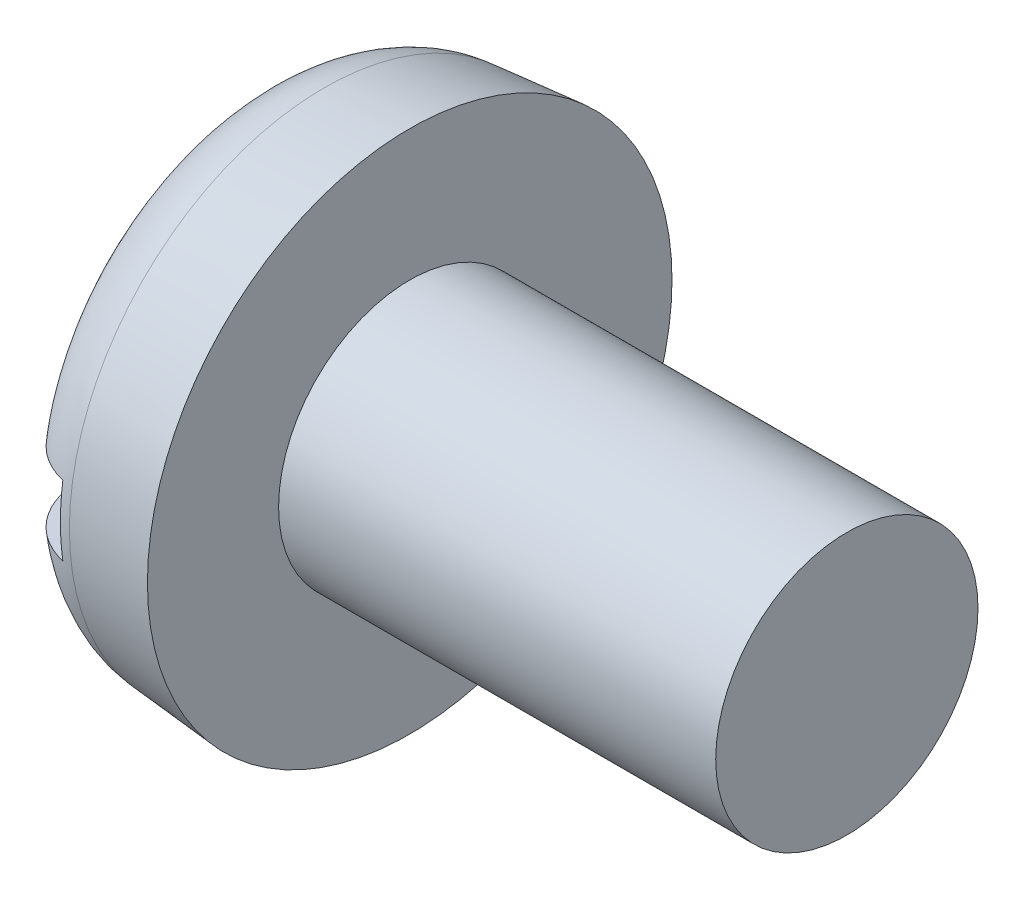
ISO-10303-21;
HEADER;
FILE_DESCRIPTION(('STEP AP214'),'2;1');
FILE_NAME('part.step','',(''),(''),'','','');
FILE_SCHEMA(('AUTOMOTIVE_DESIGN { 1 0 10303 214 1 1 1 1 }'));
ENDSEC;
DATA;
#1=APPLICATION_CONTEXT('core data for automotive mechanical design processes');
#2=APPLICATION_PROTOCOL_DEFINITION('international standard','automotive_design',2000,#1);
#3=PRODUCT_CONTEXT('',#1,'mechanical');
#4=PRODUCT('Part','Part','',(#3));
#5=PRODUCT_RELATED_PRODUCT_CATEGORY('part','',(#4));
#6=PRODUCT_DEFINITION_FORMATION('','',#4);
#7=PRODUCT_DEFINITION_CONTEXT('part definition',#1,'design');
#8=PRODUCT_DEFINITION('design','',#6,#7);
#9=PRODUCT_DEFINITION_SHAPE('','',#8);
#10=(LENGTH_UNIT() NAMED_UNIT(*) SI_UNIT(.MILLI.,.METRE.));
#11=(NAMED_UNIT(*) PLANE_ANGLE_UNIT() SI_UNIT($,.RADIAN.));
#12=(NAMED_UNIT(*) SI_UNIT($,.STERADIAN.) SOLID_ANGLE_UNIT());
#13=UNCERTAINTY_MEASURE_WITH_UNIT(LENGTH_MEASURE(1.E-05),#10,'distance_accuracy_value','');
#14=(GEOMETRIC_REPRESENTATION_CONTEXT(3) GLOBAL_UNCERTAINTY_ASSIGNED_CONTEXT((#13)) GLOBAL_UNIT_ASSIGNED_CONTEXT((#10,
#11,#12)) REPRESENTATION_CONTEXT('',''));
#15=CARTESIAN_POINT('',(0.,0.,0.));
#16=DIRECTION('',(0.,0.,1.));
#17=DIRECTION('',(1.,0.,0.));
#18=AXIS2_PLACEMENT_3D('',#15,#16,#17);
#19=CARTESIAN_POINT('',(0.,0.,0.));
#20=DIRECTION('',(-1.,0.,0.));
#21=DIRECTION('',(0.,0.,1.));
#22=AXIS2_PLACEMENT_3D('',#19,#20,#21);
#23=PLANE('',#22);
#24=DIRECTION('',(0.,0.,-1.));
#25=VECTOR('',#24,1.);
#26=CARTESIAN_POINT('',(0.,0.799999999999999,6.));
#27=LINE('',#26,#25);
#28=CARTESIAN_POINT('',(0.,0.799999999999999,3.9555566143216));
#29=VERTEX_POINT('',#28);
#30=CARTESIAN_POINT('',(0.,0.799999999999999,-3.9555566143216));
#31=VERTEX_POINT('',#30);
#32=EDGE_CURVE('E85',#29,#31,#27,.T.);
#33=ORIENTED_EDGE('',*,*,#32,.F.);
#34=CARTESIAN_POINT('',(0.,0.,0.));
#35=DIRECTION('',(-1.,0.,0.));
#36=DIRECTION('',(0.,0.,1.));
#37=AXIS2_PLACEMENT_3D('',#34,#35,#36);
#38=CIRCLE('',#37,4.03564469807531);
#39=EDGE_CURVE('E91',#29,#31,#38,.T.);
#40=ORIENTED_EDGE('',*,*,#39,.T.);
#41=EDGE_LOOP('',(#33,#40));
#42=FACE_BOUND('',#41,.T.);
#43=ADVANCED_FACE('F32',(#42),#23,.T.);
#44=CARTESIAN_POINT('',(-25.4,0.,0.));
#45=DIRECTION('',(-1.,0.,0.));
#46=DIRECTION('',(0.,0.,1.));
#47=AXIS2_PLACEMENT_3D('',#44,#45,#46);
#48=CYLINDRICAL_SURFACE('',#47,3.);
#49=CARTESIAN_POINT('',(13.6,0.,0.));
#50=DIRECTION('',(-1.,0.,0.));
#51=DIRECTION('',(0.,0.,1.));
#52=AXIS2_PLACEMENT_3D('',#49,#50,#51);
#53=CIRCLE('',#52,3.);
#54=CARTESIAN_POINT('',(13.6,0.,3.));
#55=VERTEX_POINT('',#54);
#56=EDGE_CURVE('E92',#55,#55,#53,.T.);
#57=ORIENTED_EDGE('',*,*,#56,.T.);
#58=EDGE_LOOP('',(#57));
#59=FACE_BOUND('',#58,.T.);
#60=CARTESIAN_POINT('',(3.6,0.,0.));
#61=DIRECTION('',(-1.,0.,0.));
#62=DIRECTION('',(0.,0.,1.));
#63=AXIS2_PLACEMENT_3D('',#60,#61,#62);
#64=CIRCLE('',#63,3.);
#65=CARTESIAN_POINT('',(3.6,0.,3.));
#66=VERTEX_POINT('',#65);
#67=EDGE_CURVE('E149',#66,#66,#64,.T.);
#68=ORIENTED_EDGE('',*,*,#67,.F.);
#69=EDGE_LOOP('',(#68));
#70=FACE_BOUND('',#69,.T.);
#71=ADVANCED_FACE('F137',(#59,#70),#48,.T.);
#72=CARTESIAN_POINT('',(13.6,3.,0.));
#73=DIRECTION('',(1.,0.,0.));
#74=DIRECTION('',(0.,0.,-1.));
#75=AXIS2_PLACEMENT_3D('',#72,#73,#74);
#76=PLANE('',#75);
#77=ORIENTED_EDGE('',*,*,#56,.F.);
#78=EDGE_LOOP('',(#77));
#79=FACE_BOUND('',#78,.T.);
#80=ADVANCED_FACE('F135',(#79),#76,.T.);
#81=DIRECTION('',(0.,0.,1.));
#82=VECTOR('',#81,1.);
#83=CARTESIAN_POINT('',(0.,-0.799999999999999,-6.));
#84=LINE('',#83,#82);
#85=CARTESIAN_POINT('',(0.,-0.799999999999999,-3.9555566143216));
#86=VERTEX_POINT('',#85);
#87=CARTESIAN_POINT('',(0.,-0.800000000000001,3.9555566143216));
#88=VERTEX_POINT('',#87);
#89=EDGE_CURVE('E76',#86,#88,#84,.T.);
#90=ORIENTED_EDGE('',*,*,#89,.F.);
#91=EDGE_CURVE('E83',#86,#88,#38,.T.);
#92=ORIENTED_EDGE('',*,*,#91,.T.);
#93=EDGE_LOOP('',(#90,#92));
#94=FACE_BOUND('',#93,.T.);
#95=ADVANCED_FACE('F82',(#94),#23,.T.);
#96=CARTESIAN_POINT('',(0.,0.,0.));
#97=DIRECTION('',(1.,0.,0.));
#98=DIRECTION('',(0.,0.,-1.));
#99=AXIS2_PLACEMENT_3D('',#96,#97,#98);
#100=CONICAL_SURFACE('',#99,5.68504081130667,0.0872664625997168);
#101=CARTESIAN_POINT('',(1.64311966305422,0.,0.));
#102=DIRECTION('',(-1.,0.,0.));
#103=DIRECTION('',(0.,0.,1.));
#104=AXIS2_PLACEMENT_3D('',#101,#102,#103);
#105=CIRCLE('',#104,5.82879515464045);
#106=CARTESIAN_POINT('',(1.64311966305422,0.,5.82879515464045));
#107=VERTEX_POINT('',#106);
#108=EDGE_CURVE('E95',#107,#107,#105,.F.);
#109=ORIENTED_EDGE('',*,*,#108,.T.);
#110=EDGE_LOOP('',(#109));
#111=FACE_BOUND('',#110,.T.);
#112=CARTESIAN_POINT('',(3.6,0.,0.));
#113=DIRECTION('',(-1.,0.,0.));
#114=DIRECTION('',(0.,0.,1.));
#115=AXIS2_PLACEMENT_3D('',#112,#113,#114);
#116=CIRCLE('',#115,6.);
#117=CARTESIAN_POINT('',(3.6,0.,6.));
#118=VERTEX_POINT('',#117);
#119=EDGE_CURVE('E97',#118,#118,#116,.T.);
#120=ORIENTED_EDGE('',*,*,#119,.T.);
#121=EDGE_LOOP('',(#120));
#122=FACE_BOUND('',#121,.T.);
#123=ADVANCED_FACE('F128',(#111,#122),#100,.T.);
#124=CARTESIAN_POINT('',(3.6,3.,0.));
#125=DIRECTION('',(-1.,0.,0.));
#126=DIRECTION('',(0.,0.,1.));
#127=AXIS2_PLACEMENT_3D('',#124,#125,#126);
#128=PLANE('',#127);
#129=ORIENTED_EDGE('',*,*,#119,.F.);
#130=EDGE_LOOP('',(#129));
#131=FACE_BOUND('',#130,.T.);
#132=ORIENTED_EDGE('',*,*,#67,.T.);
#133=EDGE_LOOP('',(#132));
#134=FACE_BOUND('',#133,.T.);
#135=ADVANCED_FACE('F124',(#131,#134),#128,.F.);
#136=CARTESIAN_POINT('',(1.8,0.,0.));
#137=DIRECTION('',(-1.,0.,0.));
#138=DIRECTION('',(0.,0.,1.));
#139=AXIS2_PLACEMENT_3D('',#136,#137,#138);
#140=TOROIDAL_SURFACE('',#139,4.03564469807531,1.8);
#141=CARTESIAN_POINT('',(0.540762779772504,0.799999999999999,-5.2613759856627));
#142=CARTESIAN_POINT('',(0.612348267833114,0.799999999999999,-5.33226007170116));
#143=CARTESIAN_POINT('',(0.689931624483257,0.799999999999999,-5.3971854360864));
#144=CARTESIAN_POINT('',(0.854947480958875,0.799999999999999,-5.51316161419667));
#145=CARTESIAN_POINT('',(0.94239068403974,0.799999999999999,-5.56419714083425));
#146=CARTESIAN_POINT('',(1.12461220777288,0.799999999999999,-5.650821698781));
#147=CARTESIAN_POINT('',(1.21938917495191,0.799999999999999,-5.6864135722998));
#148=CARTESIAN_POINT('',(1.41356630869313,0.799999999999999,-5.74109194486802));
#149=CARTESIAN_POINT('',(1.51296538612706,0.799999999999999,-5.76018231167996));
#150=CARTESIAN_POINT('',(1.71313899884107,0.799999999999999,-5.78126121010733));
#151=CARTESIAN_POINT('',(1.81390602781744,0.799999999999999,-5.78332104849312));
#152=CARTESIAN_POINT('',(2.01435310870812,0.799999999999999,-5.77046455591491));
#153=CARTESIAN_POINT('',(2.11403314136679,0.799999999999999,-5.75554792471215));
#154=CARTESIAN_POINT('',(2.309314019599,0.799999999999999,-5.70921606698696));
#155=CARTESIAN_POINT('',(2.40492104285082,0.799999999999999,-5.67782686375404));
#156=CARTESIAN_POINT('',(2.58952927366997,0.799999999999999,-5.59948776999251));
#157=CARTESIAN_POINT('',(2.67853045965259,0.799999999999999,-5.55253782862158));
#158=CARTESIAN_POINT('',(2.84769451709795,0.799999999999999,-5.44428887284169));
#159=CARTESIAN_POINT('',(2.92783091190503,0.799999999999999,-5.38294849495739));
#160=CARTESIAN_POINT('',(3.07676159380061,0.799999999999999,-5.24777626794688));
#161=CARTESIAN_POINT('',(3.1455556000378,0.799999999999999,-5.17394410960072));
#162=CARTESIAN_POINT('',(3.27042510006679,0.799999999999999,-5.01531035004638));
#163=CARTESIAN_POINT('',(3.32640120093555,0.799999999999999,-4.93043053468211));
#164=CARTESIAN_POINT('',(3.4235057335277,0.799999999999999,-4.75256933107917));
#165=CARTESIAN_POINT('',(3.46463341173424,0.799999999999999,-4.65958753198411));
#166=CARTESIAN_POINT('',(3.53144158740719,0.799999999999999,-4.46694835930406));
#167=CARTESIAN_POINT('',(3.55692557695194,0.799999999999999,-4.36722286731019));
#168=CARTESIAN_POINT('',(3.59108701240466,0.799999999999999,-4.16493761370543));
#169=CARTESIAN_POINT('',(3.59976314730697,0.799999999999999,-4.06237763163827));
#170=CARTESIAN_POINT('',(3.60023112204594,0.799999999999999,-3.85550711797727));
#171=CARTESIAN_POINT('',(3.59173848020812,0.799999999999999,-3.75119596435576));
#172=CARTESIAN_POINT('',(3.55768438775145,0.799999999999999,-3.54539907321037));
#173=CARTESIAN_POINT('',(3.53212117001275,0.799999999999999,-3.44391362933273));
#174=CARTESIAN_POINT('',(3.46412322657621,0.799999999999999,-3.24471369522716));
#175=CARTESIAN_POINT('',(3.42139292448942,0.799999999999999,-3.14710004339202));
#176=CARTESIAN_POINT('',(3.32030286126869,0.799999999999999,-2.96031799684206));
#177=CARTESIAN_POINT('',(3.26194098746564,0.799999999999999,-2.87115074589868));
#178=CARTESIAN_POINT('',(3.13053846590042,0.799999999999999,-2.70303664476894));
#179=CARTESIAN_POINT('',(3.05736818947569,0.799999999999999,-2.62419095430027));
#180=CARTESIAN_POINT('',(2.89859048019691,0.799999999999999,-2.48017518003935));
#181=CARTESIAN_POINT('',(2.81298317052277,0.799999999999999,-2.41500496081701));
#182=CARTESIAN_POINT('',(2.6334271917975,0.799999999999999,-2.30187272884191));
#183=CARTESIAN_POINT('',(2.53967929429022,0.799999999999999,-2.25359299068592));
#184=CARTESIAN_POINT('',(2.34507363608623,0.799999999999999,-2.17455467657048));
#185=CARTESIAN_POINT('',(2.24421969391145,0.799999999999999,-2.14378676989656));
#186=CARTESIAN_POINT('',(2.04443930043831,0.799999999999999,-2.10254396085451));
#187=CARTESIAN_POINT('',(1.94573097864464,0.799999999999999,-2.09101175757253));
#188=CARTESIAN_POINT('',(1.74783816921245,0.799999999999999,-2.08550669067498));
#189=CARTESIAN_POINT('',(1.64865381611907,0.799999999999999,-2.09152912719204));
#190=CARTESIAN_POINT('',(1.45702700128851,0.799999999999999,-2.12018138669895));
#191=CARTESIAN_POINT('',(1.36447664311325,0.799999999999999,-2.14209986414969));
#192=CARTESIAN_POINT('',(1.18420660887442,0.799999999999999,-2.20075771988038));
#193=CARTESIAN_POINT('',(1.09648771677086,0.799999999999999,-2.23749949540336));
#194=CARTESIAN_POINT('',(0.925723712262197,0.799999999999999,-2.32557805989792));
#195=CARTESIAN_POINT('',(0.842868129539058,0.799999999999999,-2.37728131212897));
#196=CARTESIAN_POINT('',(0.686362373553197,0.799999999999999,-2.493116771694));
#197=CARTESIAN_POINT('',(0.612714484293673,0.799999999999999,-2.55725205281721));
#198=CARTESIAN_POINT('',(0.472161131150062,0.799999999999999,-2.70027682193658));
#199=CARTESIAN_POINT('',(0.405916890621632,0.799999999999999,-2.77981681647101));
#200=CARTESIAN_POINT('',(0.287173334850298,0.799999999999999,-2.9485732644704));
#201=CARTESIAN_POINT('',(0.234676689699709,0.799999999999999,-3.03779159293386));
#202=CARTESIAN_POINT('',(0.143214450603964,0.799999999999999,-3.22677844667971));
#203=CARTESIAN_POINT('',(0.104782434188803,0.799999999999999,-3.32680584966186));
#204=CARTESIAN_POINT('',(0.0452446811445119,0.799999999999999,-3.5318922427284));
#205=CARTESIAN_POINT('',(0.0241387825809879,0.799999999999999,-3.63695118577701));
#206=CARTESIAN_POINT('',(-1.12670491657741E-05,0.799999999999999,-3.84916824961405));
#207=CARTESIAN_POINT('',(-0.00304965106473576,0.799999999999999,-3.95632702970971));
#208=CARTESIAN_POINT('',(0.00921984656727759,0.799999999999999,-4.16962319904359));
#209=CARTESIAN_POINT('',(0.0245310191193007,0.799999999999999,-4.27576040162512));
#210=CARTESIAN_POINT('',(0.0728327354457025,0.799999999999999,-4.48216521024852));
#211=CARTESIAN_POINT('',(0.105541716926033,0.799999999999999,-4.58249883820926));
#212=CARTESIAN_POINT('',(0.187634706209927,0.799999999999999,-4.77599767564168));
#213=CARTESIAN_POINT('',(0.236996530319204,0.799999999999999,-4.86917222023919));
#214=CARTESIAN_POINT('',(0.329466421611779,0.799999999999999,-5.01228034019194));
#215=CARTESIAN_POINT('',(0.367921794022496,0.799999999999999,-5.06527765273015));
#216=CARTESIAN_POINT('',(0.450329512489138,0.799999999999999,-5.16681267030748));
#217=CARTESIAN_POINT('',(0.494281795276485,0.799999999999999,-5.21535042666423));
#218=CARTESIAN_POINT('',(0.540762779772504,0.799999999999999,-5.2613759856627));
#219=B_SPLINE_CURVE_WITH_KNOTS('',3,(#141,#142,#143,#144,#145,#146,#147,#148,#149,#150,#151,
#152,#153,#154,#155,#156,#157,#158,#159,#160,#161,#162,#163,#164,#165,#166,#167,#168,#169,#170,
#171,#172,#173,#174,#175,#176,#177,#178,#179,#180,#181,#182,#183,#184,#185,#186,#187,#188,#189,
#190,#191,#192,#193,#194,#195,#196,#197,#198,#199,#200,#201,#202,#203,#204,#205,#206,#207,#208,
#209,#210,#211,#212,#213,#214,#215,#216,#217,#218),.UNSPECIFIED.,.T.,.F.,(4,2,2,2,2,2,2,2,2,2,2,
2,2,2,2,2,2,2,2,2,2,2,2,2,2,2,2,2,2,2,2,2,2,2,2,2,2,2,4),(0.,0.301990665553571,
0.604312368689126,0.906578409704398,1.20877358382585,1.50970282356457,1.81063738549513,
2.11109795731507,2.41155951085344,2.71289551957028,3.01423898861247,3.31784547930251,
3.6214673750267,3.92882908454075,4.23621476717483,4.54873547778502,4.86128854507609,
5.17947093252907,5.49769634531691,5.81883829248559,6.13997705919035,6.45470120134885,
6.76925749373848,7.06587349636817,7.36241009390429,7.64643650558142,7.93050886880334,
8.22223277783168,8.51402890710833,8.8231740529347,9.13237919724671,9.45232886972293,
9.77227555183242,10.0923243536798,10.4124305633264,10.7275071903339,11.042165741933,
11.2382527614178,11.4343375241794),.UNSPECIFIED.);
#220=CARTESIAN_POINT('',(1.4,0.799999999999999,-5.73510972270059));
#221=VERTEX_POINT('',#220);
#222=EDGE_CURVE('E11',#31,#221,#219,.T.);
#223=ORIENTED_EDGE('',*,*,#222,.F.);
#224=ORIENTED_EDGE('',*,*,#39,.F.);
#225=CARTESIAN_POINT('',(0.836266142673704,0.799999999999999,2.3847675344192));
#226=CARTESIAN_POINT('',(0.917616920395549,0.799999999999999,2.33037611985148));
#227=CARTESIAN_POINT('',(1.00338812809191,0.799999999999999,2.28250940898636));
#228=CARTESIAN_POINT('',(1.18171371257086,0.799999999999999,2.20157945647336));
#229=CARTESIAN_POINT('',(1.27427138419532,0.799999999999999,2.16852346158101));
#230=CARTESIAN_POINT('',(1.46387360375784,0.799999999999999,2.11861651463578));
#231=CARTESIAN_POINT('',(1.56092620726988,0.799999999999999,2.10179593736475));
#232=CARTESIAN_POINT('',(1.75645828986596,0.799999999999999,2.08531619913094));
#233=CARTESIAN_POINT('',(1.85493729786073,0.799999999999999,2.08565149582934));
#234=CARTESIAN_POINT('',(2.04724581885373,0.799999999999999,2.10316628821439));
#235=CARTESIAN_POINT('',(2.1411242466631,0.799999999999999,2.11981673272017));
#236=CARTESIAN_POINT('',(2.32483197664105,0.799999999999999,2.16840533825103));
#237=CARTESIAN_POINT('',(2.41466058319104,0.799999999999999,2.20034611475993));
#238=CARTESIAN_POINT('',(2.58937479658255,0.799999999999999,2.27883470838468));
#239=CARTESIAN_POINT('',(2.67416016608233,0.799999999999999,2.32560484151197));
#240=CARTESIAN_POINT('',(2.83527159661578,0.799999999999999,2.43194790875205));
#241=CARTESIAN_POINT('',(2.91159566808818,0.799999999999999,2.4915238443409));
#242=CARTESIAN_POINT('',(3.05833847206813,0.799999999999999,2.62557742394097));
#243=CARTESIAN_POINT('',(3.12814463920814,0.799999999999999,2.70072607421442));
#244=CARTESIAN_POINT('',(3.25476371599267,0.799999999999999,2.86127427469928));
#245=CARTESIAN_POINT('',(3.31157384747779,0.799999999999999,2.94667601077194));
#246=CARTESIAN_POINT('',(3.41282909605205,0.799999999999999,3.12914373500798));
#247=CARTESIAN_POINT('',(3.4566732787476,0.799999999999999,3.22654397769993));
#248=CARTESIAN_POINT('',(3.52749042959911,0.799999999999999,3.42730182448779));
#249=CARTESIAN_POINT('',(3.55446245509905,0.799999999999999,3.53065976109082));
#250=CARTESIAN_POINT('',(3.59074777581197,0.799999999999999,3.74099682308468));
#251=CARTESIAN_POINT('',(3.59996828480699,0.799999999999999,3.84799201669904));
#252=CARTESIAN_POINT('',(3.60003154521387,0.799999999999999,4.06199242805616));
#253=CARTESIAN_POINT('',(3.59087543963191,0.799999999999999,4.16899764476154));
#254=CARTESIAN_POINT('',(3.5545508836994,0.799999999999999,4.37828946953499));
#255=CARTESIAN_POINT('',(3.5276490501339,0.799999999999999,4.48062230606525));
#256=CARTESIAN_POINT('',(3.45672417667962,0.799999999999999,4.67917518429467));
#257=CARTESIAN_POINT('',(3.41270279239386,0.799999999999999,4.77539581604843));
#258=CARTESIAN_POINT('',(3.30967441571423,0.799999999999999,4.95711293936014));
#259=CARTESIAN_POINT('',(3.2509575917222,0.799999999999999,5.04277397494754));
#260=CARTESIAN_POINT('',(3.11977209379603,0.799999999999999,5.20282644762345));
#261=CARTESIAN_POINT('',(3.04730458946901,0.799999999999999,5.27721884223437));
#262=CARTESIAN_POINT('',(2.89186263836087,0.799999999999999,5.41145672931945));
#263=CARTESIAN_POINT('',(2.80906226498412,0.799999999999999,5.47150384635816));
#264=CARTESIAN_POINT('',(2.63447307414862,0.799999999999999,5.57667826647956));
#265=CARTESIAN_POINT('',(2.54268479385402,0.799999999999999,5.62180646049025));
#266=CARTESIAN_POINT('',(2.35372245855627,0.799999999999999,5.69541178601739));
#267=CARTESIAN_POINT('',(2.25661170214885,0.799999999999999,5.72405148642268));
#268=CARTESIAN_POINT('',(2.05894963569563,0.799999999999999,5.76452632903134));
#269=CARTESIAN_POINT('',(1.95839844559039,0.799999999999999,5.77636205644549));
#270=CARTESIAN_POINT('',(1.75726466993558,0.799999999999999,5.78286013265482));
#271=CARTESIAN_POINT('',(1.65668492734368,0.799999999999999,5.77761084028505));
#272=CARTESIAN_POINT('',(1.45783846372769,0.799999999999999,5.75028865632157));
#273=CARTESIAN_POINT('',(1.35957171560434,0.799999999999999,5.72821596193375));
#274=CARTESIAN_POINT('',(1.16819371267695,0.799999999999999,5.66791633540255));
#275=CARTESIAN_POINT('',(1.07507939389964,0.799999999999999,5.62969912319174));
#276=CARTESIAN_POINT('',(0.896555358732774,0.799999999999999,5.53823241598758));
#277=CARTESIAN_POINT('',(0.811145708608114,0.799999999999999,5.4849827917225));
#278=CARTESIAN_POINT('',(0.650082876219721,0.799999999999999,5.36476593037792));
#279=CARTESIAN_POINT('',(0.574468804826387,0.799999999999999,5.29774630893073));
#280=CARTESIAN_POINT('',(0.435451535945253,0.799999999999999,5.15205983914348));
#281=CARTESIAN_POINT('',(0.372048731656855,0.799999999999999,5.07339261589811));
#282=CARTESIAN_POINT('',(0.258650816330336,0.799999999999999,4.90594446263168));
#283=CARTESIAN_POINT('',(0.208774635933078,0.799999999999999,4.81708301699831));
#284=CARTESIAN_POINT('',(0.124428147888649,0.799999999999999,4.63233098726459));
#285=CARTESIAN_POINT('',(0.0899587510920719,0.799999999999999,4.53643998796633));
#286=CARTESIAN_POINT('',(0.0368868820421768,0.799999999999999,4.33899079972006));
#287=CARTESIAN_POINT('',(0.0185025255877267,0.799999999999999,4.23737401613092));
#288=CARTESIAN_POINT('',(-0.00125734799088122,0.799999999999999,4.03250747712129));
#289=CARTESIAN_POINT('',(-0.00263209949744705,0.799999999999999,3.9292576484054));
#290=CARTESIAN_POINT('',(0.0116307665412094,0.799999999999999,3.72214563494947));
#291=CARTESIAN_POINT('',(0.0275632061751764,0.799999999999999,3.61830377486544));
#292=CARTESIAN_POINT('',(0.0763335967887615,0.799999999999999,3.41464106293113));
#293=CARTESIAN_POINT('',(0.10917724967951,0.799999999999999,3.31482157954313));
#294=CARTESIAN_POINT('',(0.191511099721982,0.799999999999999,3.12021092040486));
#295=CARTESIAN_POINT('',(0.241286347194323,0.799999999999999,3.02554040328379));
#296=CARTESIAN_POINT('',(0.355915618814842,0.799999999999999,2.8458978279608));
#297=CARTESIAN_POINT('',(0.420755571218364,0.799999999999999,2.76091682866338));
#298=CARTESIAN_POINT('',(0.543269993526277,0.799999999999999,2.62572980615078));
#299=CARTESIAN_POINT('',(0.597683333164855,0.799999999999999,2.57253239665292));
#300=CARTESIAN_POINT('',(0.712598229155983,0.799999999999999,2.4731680246369));
#301=CARTESIAN_POINT('',(0.773099631725334,0.799999999999999,2.42700088460961));
#302=CARTESIAN_POINT('',(0.836266142673704,0.799999999999999,2.3847675344192));
#303=B_SPLINE_CURVE_WITH_KNOTS('',3,(#225,#226,#227,#228,#229,#230,#231,#232,#233,#234,#235,
#236,#237,#238,#239,#240,#241,#242,#243,#244,#245,#246,#247,#248,#249,#250,#251,#252,#253,#254,
#255,#256,#257,#258,#259,#260,#261,#262,#263,#264,#265,#266,#267,#268,#269,#270,#271,#272,#273,
#274,#275,#276,#277,#278,#279,#280,#281,#282,#283,#284,#285,#286,#287,#288,#289,#290,#291,#292,
#293,#294,#295,#296,#297,#298,#299,#300,#301,#302),.UNSPECIFIED.,.T.,.F.,(4,2,2,2,2,2,2,2,2,2,2,
2,2,2,2,2,2,2,2,2,2,2,2,2,2,2,2,2,2,2,2,2,2,2,2,2,2,2,4),(0.,0.293321979457734,
0.586787322516146,0.880800650631159,1.17471899604829,1.45941156882231,1.74415285702185,
2.03338255615662,2.32268012018922,2.62901646924018,2.93541824267213,3.25435495988079,
3.57330949465531,3.89392670887913,4.21452398166584,4.53041098625831,4.84626744954258,
5.1563211071772,5.46634840404057,5.77172128030291,6.0770759170173,6.37936593322563,
6.6816454217023,6.98236409614661,7.2830792455858,7.5836136045785,7.88415054810525,
8.18585270916065,8.48756458331813,8.79184901385485,9.09615143133901,9.40451898940015,
9.71290042731147,10.0266186112637,10.3404426401165,10.6598354635326,10.9789311372724,
11.2066928680963,11.43444884715),.UNSPECIFIED.);
#304=CARTESIAN_POINT('',(1.4,0.799999999999999,5.73510972270059));
#305=VERTEX_POINT('',#304);
#306=EDGE_CURVE('E109',#305,#29,#303,.T.);
#307=ORIENTED_EDGE('',*,*,#306,.F.);
#308=CARTESIAN_POINT('',(1.4,0.,0.));
#309=DIRECTION('',(-1.,0.,0.));
#310=DIRECTION('',(0.,0.,1.));
#311=AXIS2_PLACEMENT_3D('',#308,#309,#310);
#312=CIRCLE('',#311,5.79063757555374);
#313=CARTESIAN_POINT('',(1.4,-0.800000000000001,5.73510972270059));
#314=VERTEX_POINT('',#313);
#315=EDGE_CURVE('E103',#305,#314,#312,.F.);
#316=ORIENTED_EDGE('',*,*,#315,.T.);
#317=CARTESIAN_POINT('',(0.836266142673704,-0.8,2.3847675344192));
#318=CARTESIAN_POINT('',(0.748506893430262,-0.8,2.44345191414655));
#319=CARTESIAN_POINT('',(0.665766647879348,-0.8,2.50981960320106));
#320=CARTESIAN_POINT('',(0.512551256365541,-0.8,2.65561376218173));
#321=CARTESIAN_POINT('',(0.442099246823711,-0.8,2.73506432962604));
#322=CARTESIAN_POINT('',(0.315475262434064,-0.8,2.90443495121528));
#323=CARTESIAN_POINT('',(0.259280268430428,-0.8,2.99433778254075));
#324=CARTESIAN_POINT('',(0.162548938959551,-0.8,3.18215299216268));
#325=CARTESIAN_POINT('',(0.122006089879258,-0.8,3.28006201809487));
#326=CARTESIAN_POINT('',(0.0572425021539008,-0.8,3.4827212450359));
#327=CARTESIAN_POINT('',(0.0332676369124984,-0.8,3.58755021276299));
#328=CARTESIAN_POINT('',(0.00342578696207535,-0.8,3.79976969875038));
#329=CARTESIAN_POINT('',(-0.00244009682357875,-0.800000000000001,3.90716037234792));
#330=CARTESIAN_POINT('',(0.00425089062541546,-0.800000000000001,4.12040369131769));
#331=CARTESIAN_POINT('',(0.0166422393499398,-0.800000000000001,4.22626147612868));
#332=CARTESIAN_POINT('',(0.0593599277228411,-0.800000000000001,4.43429705562788));
#333=CARTESIAN_POINT('',(0.0896844898843742,-0.800000000000001,4.53647521396505));
#334=CARTESIAN_POINT('',(0.166811113143519,-0.800000000000001,4.73226366726684));
#335=CARTESIAN_POINT('',(0.21330327024463,-0.800000000000001,4.82599604324917));
#336=CARTESIAN_POINT('',(0.32162267572296,-0.800000000000001,5.00413844404781));
#337=CARTESIAN_POINT('',(0.383448471720297,-0.800000000000001,5.08854935068632));
#338=CARTESIAN_POINT('',(0.519544306999233,-0.800000000000001,5.24416143149033));
#339=CARTESIAN_POINT('',(0.593588166123753,-0.800000000000001,5.31556046719266));
#340=CARTESIAN_POINT('',(0.752739555835971,-0.800000000000001,5.44472836027191));
#341=CARTESIAN_POINT('',(0.837846323514925,-0.800000000000001,5.5024981567616));
#342=CARTESIAN_POINT('',(1.01558854842572,-0.800000000000001,5.60205300956143));
#343=CARTESIAN_POINT('',(1.10812041731753,-0.800000000000001,5.64402306987624));
#344=CARTESIAN_POINT('',(1.29895009056469,-0.800000000000001,5.71170590778668));
#345=CARTESIAN_POINT('',(1.39724763350181,-0.800000000000001,5.7374194218397));
#346=CARTESIAN_POINT('',(1.59606633976361,-0.800000000000001,5.77169733961628));
#347=CARTESIAN_POINT('',(1.69656671478609,-0.800000000000001,5.78038241634162));
#348=CARTESIAN_POINT('',(1.89759433538528,-0.800000000000001,5.78071120137491));
#349=CARTESIAN_POINT('',(1.99812158035831,-0.800000000000001,5.77235526485593));
#350=CARTESIAN_POINT('',(2.19609344292374,-0.800000000000001,5.73889133318644));
#351=CARTESIAN_POINT('',(2.29354498303738,-0.800000000000001,5.71382425898093));
#352=CARTESIAN_POINT('',(2.48286854703151,-0.800000000000001,5.64771711956062));
#353=CARTESIAN_POINT('',(2.57474056774009,-0.800000000000001,5.60667704526538));
#354=CARTESIAN_POINT('',(2.75051258087327,-0.800000000000001,5.50972539102507));
#355=CARTESIAN_POINT('',(2.8343959465404,-0.800000000000001,5.45378367661804));
#356=CARTESIAN_POINT('',(2.99165678299636,-0.800000000000001,5.32869697027017));
#357=CARTESIAN_POINT('',(3.06503402042885,-0.800000000000001,5.25955168513844));
#358=CARTESIAN_POINT('',(3.19973989676036,-0.800000000000001,5.10955333442706));
#359=CARTESIAN_POINT('',(3.26098586193472,-0.800000000000001,5.02862604540654));
#360=CARTESIAN_POINT('',(3.36919753390679,-0.800000000000001,4.85773374858047));
#361=CARTESIAN_POINT('',(3.41616259992529,-0.800000000000001,4.76776833547817));
#362=CARTESIAN_POINT('',(3.49507738631938,-0.800000000000001,4.5802716594319));
#363=CARTESIAN_POINT('',(3.52685014697164,-0.800000000000001,4.48266594703615));
#364=CARTESIAN_POINT('',(3.57383908213109,-0.800000000000001,4.28355151356638));
#365=CARTESIAN_POINT('',(3.58905405146405,-0.800000000000001,4.18204250894425));
#366=CARTESIAN_POINT('',(3.60277332841501,-0.800000000000001,3.97627512738235));
#367=CARTESIAN_POINT('',(3.60100695654502,-0.8,3.87199872990389));
#368=CARTESIAN_POINT('',(3.58032198396241,-0.8,3.66516328359259));
#369=CARTESIAN_POINT('',(3.56140169370222,-0.8,3.56260440493742));
#370=CARTESIAN_POINT('',(3.50655445326333,-0.8,3.3601262182977));
#371=CARTESIAN_POINT('',(3.47032341934756,-0.8,3.26028924640596));
#372=CARTESIAN_POINT('',(3.38182060870726,-0.8,3.06798854276054));
#373=CARTESIAN_POINT('',(3.32954675396352,-0.8,2.97552576813911));
#374=CARTESIAN_POINT('',(3.20964725567174,-0.8,2.79948120171889));
#375=CARTESIAN_POINT('',(3.14184223712501,-0.8,2.71602141217628));
#376=CARTESIAN_POINT('',(2.99302219632622,-0.8,2.56181483592421));
#377=CARTESIAN_POINT('',(2.91200632330115,-0.8,2.49106886859632));
#378=CARTESIAN_POINT('',(2.73997760711788,-0.8,2.36551639760888));
#379=CARTESIAN_POINT('',(2.64910309983349,-0.8,2.31052086250488));
#380=CARTESIAN_POINT('',(2.4590409075158,-0.8,2.21753014012797));
#381=CARTESIAN_POINT('',(2.35985743984191,-0.8,2.17952638970964));
#382=CARTESIAN_POINT('',(2.16147923078881,-0.8,2.12383562208936));
#383=CARTESIAN_POINT('',(2.06255196747457,-0.8,2.10519696055357));
#384=CARTESIAN_POINT('',(1.86294330184555,-0.8,2.08580594361597));
#385=CARTESIAN_POINT('',(1.76226208748034,-0.8,2.08505168341593));
#386=CARTESIAN_POINT('',(1.56749167167987,-0.8,2.1010369991765));
#387=CARTESIAN_POINT('',(1.47332742294699,-0.8,2.11688981083895));
#388=CARTESIAN_POINT('',(1.28901868791397,-0.8,2.16397488361137));
#389=CARTESIAN_POINT('',(1.19886974388066,-0.8,2.19518960135132));
#390=CARTESIAN_POINT('',(1.0638315376683,-0.8,2.25452352584505));
#391=CARTESIAN_POINT('',(1.01673933731484,-0.8,2.27777851827377));
#392=CARTESIAN_POINT('',(0.924773358306767,-0.8,2.32831196324339));
#393=CARTESIAN_POINT('',(0.879899400191995,-0.8,2.35559008959122));
#394=CARTESIAN_POINT('',(0.836266142673704,-0.8,2.3847675344192));
#395=B_SPLINE_CURVE_WITH_KNOTS('',3,(#317,#318,#319,#320,#321,#322,#323,#324,#325,#326,#327,
#328,#329,#330,#331,#332,#333,#334,#335,#336,#337,#338,#339,#340,#341,#342,#343,#344,#345,#346,
#347,#348,#349,#350,#351,#352,#353,#354,#355,#356,#357,#358,#359,#360,#361,#362,#363,#364,#365,
#366,#367,#368,#369,#370,#371,#372,#373,#374,#375,#376,#377,#378,#379,#380,#381,#382,#383,#384,
#385,#386,#387,#388,#389,#390,#391,#392,#393,#394),.UNSPECIFIED.,.T.,.F.,(4,2,2,2,2,2,2,2,2,2,2,
2,2,2,2,2,2,2,2,2,2,2,2,2,2,2,2,2,2,2,2,2,2,2,2,2,2,2,4),(0.,0.316518163802674,
0.633625985041103,0.950218502983176,1.2666791291138,1.58774070740088,1.90882180402667,
2.22700979028291,2.54516624397578,2.8575328146744,3.16986980975956,3.47696670296019,
3.78404242968966,4.08740155648282,4.39074693945368,4.69193476499599,4.99311631317029,
5.29356304698593,5.59400995160177,5.89506910144275,6.19613493720729,6.49918680513006,
6.80225226888417,7.10876667239494,7.41530338434966,7.72673423590704,8.03819576467738,
8.35534173040458,8.6725287932536,8.99358246518054,9.31465682098899,9.63169865945437,
9.94858054156723,10.2490245150223,10.549436489211,10.8345871229657,11.1194128663603,
11.276796138315,11.4341666567444),.UNSPECIFIED.);
#396=EDGE_CURVE('E90',#88,#314,#395,.T.);
#397=ORIENTED_EDGE('',*,*,#396,.F.);
#398=ORIENTED_EDGE('',*,*,#91,.F.);
#399=CARTESIAN_POINT('',(0.540762779772504,-0.799999999999999,-5.2613759856627));
#400=CARTESIAN_POINT('',(0.46800256363268,-0.799999999999999,-5.18931554071322));
#401=CARTESIAN_POINT('',(0.401331971706955,-0.799999999999999,-5.11098969601857));
#402=CARTESIAN_POINT('',(0.282092817877179,-0.799999999999999,-4.94415021175995));
#403=CARTESIAN_POINT('',(0.229543536062353,-0.799999999999999,-4.85562287702027));
#404=CARTESIAN_POINT('',(0.140058245351338,-0.799999999999999,-4.67111833353568));
#405=CARTESIAN_POINT('',(0.103104998671601,-0.799999999999999,-4.57514948930957));
#406=CARTESIAN_POINT('',(0.0456444426045715,-0.799999999999999,-4.37844736615043));
#407=CARTESIAN_POINT('',(0.0251330097273497,-0.799999999999999,-4.27771528851783));
#408=CARTESIAN_POINT('',(0.000807407176632478,-0.799999999999999,-4.07306902098841));
#409=CARTESIAN_POINT('',(-0.00280970089343009,-0.799999999999999,-3.96913144304401));
#410=CARTESIAN_POINT('',(0.00712688275186644,-0.799999999999999,-3.76207815435696));
#411=CARTESIAN_POINT('',(0.0206829358886569,-0.8,-3.65896255860433));
#412=CARTESIAN_POINT('',(0.0648595926784728,-0.8,-3.45448287681273));
#413=CARTESIAN_POINT('',(0.0957869506993027,-0.8,-3.35318504696212));
#414=CARTESIAN_POINT('',(0.173966954794269,-0.8,-3.15709227715185));
#415=CARTESIAN_POINT('',(0.221221562923288,-0.8,-3.06229812038397));
#416=CARTESIAN_POINT('',(0.331523815298362,-0.8,-2.8805427251143));
#417=CARTESIAN_POINT('',(0.394784707298973,-0.8,-2.79371074818629));
#418=CARTESIAN_POINT('',(0.535080660930294,-0.8,-2.63196239249016));
#419=CARTESIAN_POINT('',(0.612117058399806,-0.8,-2.5570471706465));
#420=CARTESIAN_POINT('',(0.777363260012997,-0.8,-2.42207446625528));
#421=CARTESIAN_POINT('',(0.865488934385647,-0.8,-2.36191424206404));
#422=CARTESIAN_POINT('',(1.05097305679666,-0.8,-2.25807126721941));
#423=CARTESIAN_POINT('',(1.1483280520288,-0.8,-2.21438238463351));
#424=CARTESIAN_POINT('',(1.34472607812469,-0.8,-2.14709500481578));
#425=CARTESIAN_POINT('',(1.44348146104708,-0.8,-2.12265879049043));
#426=CARTESIAN_POINT('',(1.64375523069054,-0.8,-2.09184121198385));
#427=CARTESIAN_POINT('',(1.74527230567127,-0.8,-2.08545142227402));
#428=CARTESIAN_POINT('',(1.94205144408969,-0.8,-2.09089422506859));
#429=CARTESIAN_POINT('',(2.03734311949205,-0.8,-2.1017185632254));
#430=CARTESIAN_POINT('',(2.22475371383136,-0.8,-2.1391955846988));
#431=CARTESIAN_POINT('',(2.31687240596036,-0.8,-2.16584939704786));
#432=CARTESIAN_POINT('',(2.49568716119116,-0.8,-2.23389898004642));
#433=CARTESIAN_POINT('',(2.58237134592021,-0.8,-2.27532580427772));
#434=CARTESIAN_POINT('',(2.74807422342881,-0.8,-2.37138684264316));
#435=CARTESIAN_POINT('',(2.82709115345045,-0.8,-2.42602408391441));
#436=CARTESIAN_POINT('',(2.9799165498153,-0.8,-2.55022645282286));
#437=CARTESIAN_POINT('',(3.05318434040937,-0.8,-2.6204569537642));
#438=CARTESIAN_POINT('',(3.18755425676067,-0.8,-2.77172635941064));
#439=CARTESIAN_POINT('',(3.24865355341293,-0.8,-2.85276777029418));
#440=CARTESIAN_POINT('',(3.35979277989752,-0.8,-3.02754470544871));
#441=CARTESIAN_POINT('',(3.40917690754713,-0.8,-3.1216981474667));
#442=CARTESIAN_POINT('',(3.49164209646366,-0.8,-3.31689856469016));
#443=CARTESIAN_POINT('',(3.52472176899937,-0.8,-3.41794612626776));
#444=CARTESIAN_POINT('',(3.57383047041871,-0.8,-3.62528781310289));
#445=CARTESIAN_POINT('',(3.58966846310995,-0.8,-3.73162733467862));
#446=CARTESIAN_POINT('',(3.60302482384296,-0.8,-3.94545563862676));
#447=CARTESIAN_POINT('',(3.60054405344453,-0.799999999999999,-4.05294436671279));
#448=CARTESIAN_POINT('',(3.57730809784689,-0.799999999999999,-4.26456838674987));
#449=CARTESIAN_POINT('',(3.5567824615156,-0.799999999999999,-4.36872882792955));
#450=CARTESIAN_POINT('',(3.49820144771329,-0.799999999999999,-4.57200098520051));
#451=CARTESIAN_POINT('',(3.46014775773205,-0.799999999999999,-4.67111318628443));
#452=CARTESIAN_POINT('',(3.36835841151673,-0.799999999999999,-4.85952398282424));
#453=CARTESIAN_POINT('',(3.31492535462002,-0.799999999999999,-4.94897001417914));
#454=CARTESIAN_POINT('',(3.19357222893311,-0.799999999999999,-5.1174283983712));
#455=CARTESIAN_POINT('',(3.12565341930971,-0.799999999999999,-5.196441657106));
#456=CARTESIAN_POINT('',(2.97843308341649,-0.799999999999999,-5.34047951369632));
#457=CARTESIAN_POINT('',(2.89932889793228,-0.799999999999999,-5.40570586481735));
#458=CARTESIAN_POINT('',(2.73119091898371,-0.799999999999999,-5.52177624162289));
#459=CARTESIAN_POINT('',(2.64215774589779,-0.799999999999999,-5.57262116517992));
#460=CARTESIAN_POINT('',(2.45774484574963,-0.799999999999999,-5.65792437324546));
#461=CARTESIAN_POINT('',(2.36244515719274,-0.799999999999999,-5.69255575276872));
#462=CARTESIAN_POINT('',(2.16736859982667,-0.799999999999999,-5.7452167534151));
#463=CARTESIAN_POINT('',(2.06759209093544,-0.799999999999999,-5.76324770664509));
#464=CARTESIAN_POINT('',(1.8670464863071,-0.799999999999999,-5.78211504492871));
#465=CARTESIAN_POINT('',(1.76628722683028,-0.799999999999999,-5.78305617360559));
#466=CARTESIAN_POINT('',(1.56601778316069,-0.799999999999999,-5.76798048930461));
#467=CARTESIAN_POINT('',(1.46650790933745,-0.799999999999999,-5.75195954380567));
#468=CARTESIAN_POINT('',(1.27169371218594,-0.799999999999999,-5.70345798483568));
#469=CARTESIAN_POINT('',(1.17638560748521,-0.799999999999999,-5.67099251343592));
#470=CARTESIAN_POINT('',(0.992639439872283,-0.799999999999999,-5.59058259530451));
#471=CARTESIAN_POINT('',(0.904192951568145,-0.799999999999999,-5.54265751695209));
#472=CARTESIAN_POINT('',(0.770167972453533,-0.799999999999999,-5.45480755502994));
#473=CARTESIAN_POINT('',(0.72159797671617,-0.799999999999999,-5.41935523487936));
#474=CARTESIAN_POINT('',(0.628240795352934,-0.799999999999999,-5.34377955839393));
#475=CARTESIAN_POINT('',(0.583453594173323,-0.799999999999999,-5.30365622126655));
#476=CARTESIAN_POINT('',(0.540762779772504,-0.799999999999999,-5.2613759856627));
#477=B_SPLINE_CURVE_WITH_KNOTS('',3,(#399,#400,#401,#402,#403,#404,#405,#406,#407,#408,#409,
#410,#411,#412,#413,#414,#415,#416,#417,#418,#419,#420,#421,#422,#423,#424,#425,#426,#427,#428,
#429,#430,#431,#432,#433,#434,#435,#436,#437,#438,#439,#440,#441,#442,#443,#444,#445,#446,#447,
#448,#449,#450,#451,#452,#453,#454,#455,#456,#457,#458,#459,#460,#461,#462,#463,#464,#465,#466,
#467,#468,#469,#470,#471,#472,#473,#474,#475,#476),.UNSPECIFIED.,.T.,.F.,(4,2,2,2,2,2,2,2,2,2,2,
2,2,2,2,2,2,2,2,2,2,2,2,2,2,2,2,2,2,2,2,2,2,2,2,2,2,2,4),(0.,0.306991422181552,0.61439988016063,
0.921467674223052,1.22845843375204,1.53902124968411,1.84962677466023,2.1658978762407,
2.48220699752465,2.80297521633035,3.12377455756811,3.4422723020991,3.76065135929225,
4.06426589424078,4.36773865394976,4.65408102504908,4.94044382188495,5.22741215014114,
5.51444629896418,5.81757894484908,6.12078198527096,6.43825439592393,6.75575384260397,
7.07673643314107,7.39770392746607,7.71464653140136,8.03155862848969,8.34261788306675,
8.65365010998577,8.95975564746201,9.2658420696977,9.56858170023437,9.87129703520847,
10.1721563958159,10.4730890725641,10.7737451537516,11.0740260151275,11.254148730699,
11.4342707056229),.UNSPECIFIED.);
#478=CARTESIAN_POINT('',(1.4,-0.799999999999999,-5.73510972270059));
#479=VERTEX_POINT('',#478);
#480=EDGE_CURVE('E44',#479,#86,#477,.T.);
#481=ORIENTED_EDGE('',*,*,#480,.F.);
#482=EDGE_CURVE('E56',#479,#221,#312,.F.);
#483=ORIENTED_EDGE('',*,*,#482,.T.);
#484=EDGE_LOOP('',(#223,#224,#307,#316,#397,#398,#481,#483));
#485=FACE_BOUND('',#484,.T.);
#486=ORIENTED_EDGE('',*,*,#108,.F.);
#487=EDGE_LOOP('',(#486));
#488=FACE_BOUND('',#487,.T.);
#489=ADVANCED_FACE('F34',(#485,#488),#140,.T.);
#490=CARTESIAN_POINT('',(1.4,0.799999999999999,6.));
#491=DIRECTION('',(0.,1.,0.));
#492=DIRECTION('',(0.,0.,1.));
#493=AXIS2_PLACEMENT_3D('',#490,#491,#492);
#494=PLANE('',#493);
#495=ORIENTED_EDGE('',*,*,#222,.T.);
#496=DIRECTION('',(0.,0.,-1.));
#497=VECTOR('',#496,1.);
#498=CARTESIAN_POINT('',(1.4,0.799999999999999,6.));
#499=LINE('',#498,#497);
#500=EDGE_CURVE('E84',#305,#221,#499,.T.);
#501=ORIENTED_EDGE('',*,*,#500,.F.);
#502=ORIENTED_EDGE('',*,*,#306,.T.);
#503=ORIENTED_EDGE('',*,*,#32,.T.);
#504=EDGE_LOOP('',(#495,#501,#502,#503));
#505=FACE_BOUND('',#504,.T.);
#506=ADVANCED_FACE('F116',(#505),#494,.F.);
#507=CARTESIAN_POINT('',(1.4,-0.799999999999999,-6.));
#508=DIRECTION('',(0.,-1.,0.));
#509=DIRECTION('',(0.,0.,-1.));
#510=AXIS2_PLACEMENT_3D('',#507,#508,#509);
#511=PLANE('',#510);
#512=ORIENTED_EDGE('',*,*,#480,.T.);
#513=ORIENTED_EDGE('',*,*,#89,.T.);
#514=ORIENTED_EDGE('',*,*,#396,.T.);
#515=DIRECTION('',(0.,0.,1.));
#516=VECTOR('',#515,1.);
#517=CARTESIAN_POINT('',(1.4,-0.799999999999999,-6.));
#518=LINE('',#517,#516);
#519=EDGE_CURVE('E51',#479,#314,#518,.T.);
#520=ORIENTED_EDGE('',*,*,#519,.F.);
#521=EDGE_LOOP('',(#512,#513,#514,#520));
#522=FACE_BOUND('',#521,.T.);
#523=ADVANCED_FACE('F75',(#522),#511,.F.);
#524=CARTESIAN_POINT('',(1.4,0.799999999999999,-6.));
#525=DIRECTION('',(-1.,0.,0.));
#526=DIRECTION('',(0.,0.,1.));
#527=AXIS2_PLACEMENT_3D('',#524,#525,#526);
#528=PLANE('',#527);
#529=ORIENTED_EDGE('',*,*,#519,.T.);
#530=ORIENTED_EDGE('',*,*,#315,.F.);
#531=ORIENTED_EDGE('',*,*,#500,.T.);
#532=ORIENTED_EDGE('',*,*,#482,.F.);
#533=EDGE_LOOP('',(#529,#530,#531,#532));
#534=FACE_BOUND('',#533,.T.);
#535=ADVANCED_FACE('F115',(#534),#528,.T.);
#536=CLOSED_SHELL('',(#43,#71,#80,#95,#123,#135,#489,#506,#523,#535));
#537=MANIFOLD_SOLID_BREP('B2',#536);
#538=ADVANCED_BREP_SHAPE_REPRESENTATION('',(#18,#537),#14);
#539=SHAPE_DEFINITION_REPRESENTATION(#9,#538);
ENDSEC;
END-ISO-10303-21;
